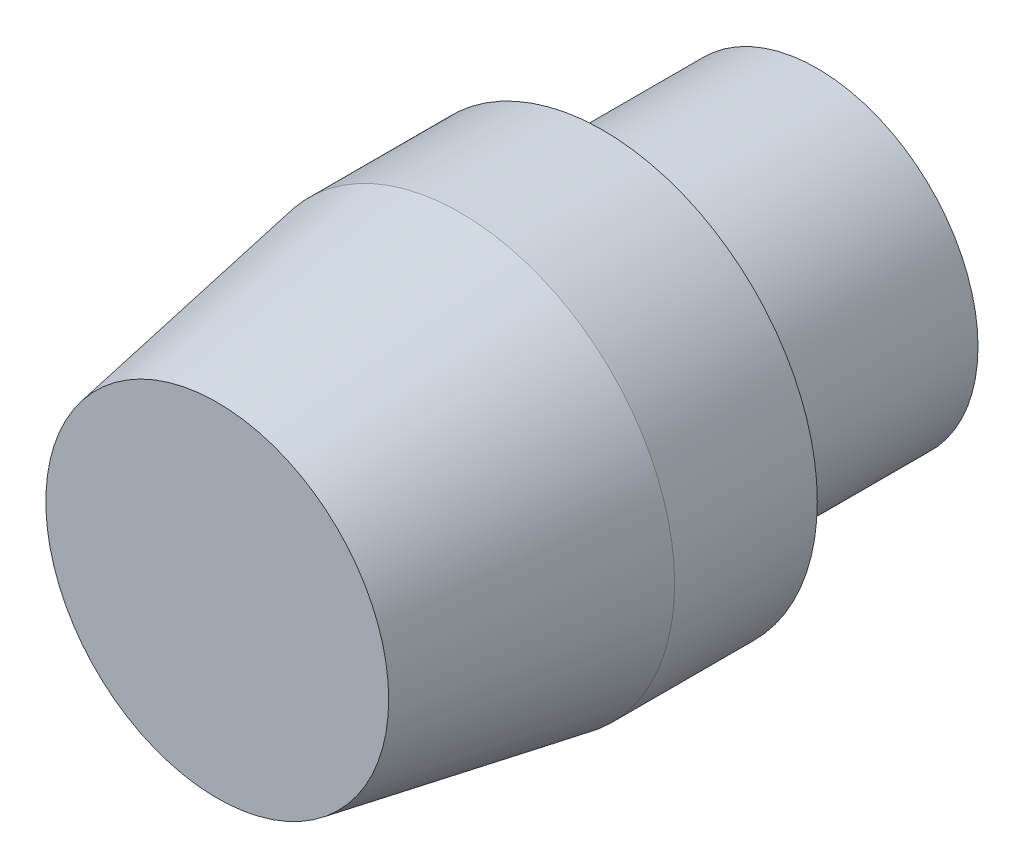
ISO-10303-21;
HEADER;
FILE_DESCRIPTION(('STEP AP214'),'2;1');
FILE_NAME('part.step','',(''),(''),'','','');
FILE_SCHEMA(('AUTOMOTIVE_DESIGN { 1 0 10303 214 1 1 1 1 }'));
ENDSEC;
DATA;
#1=APPLICATION_CONTEXT('core data for automotive mechanical design processes');
#2=APPLICATION_PROTOCOL_DEFINITION('international standard','automotive_design',2000,#1);
#3=PRODUCT_CONTEXT('',#1,'mechanical');
#4=PRODUCT('Part','Part','',(#3));
#5=PRODUCT_RELATED_PRODUCT_CATEGORY('part','',(#4));
#6=PRODUCT_DEFINITION_FORMATION('','',#4);
#7=PRODUCT_DEFINITION_CONTEXT('part definition',#1,'design');
#8=PRODUCT_DEFINITION('design','',#6,#7);
#9=PRODUCT_DEFINITION_SHAPE('','',#8);
#10=(LENGTH_UNIT() NAMED_UNIT(*) SI_UNIT(.MILLI.,.METRE.));
#11=(NAMED_UNIT(*) PLANE_ANGLE_UNIT() SI_UNIT($,.RADIAN.));
#12=(NAMED_UNIT(*) SI_UNIT($,.STERADIAN.) SOLID_ANGLE_UNIT());
#13=UNCERTAINTY_MEASURE_WITH_UNIT(LENGTH_MEASURE(1.E-05),#10,'distance_accuracy_value','');
#14=(GEOMETRIC_REPRESENTATION_CONTEXT(3) GLOBAL_UNCERTAINTY_ASSIGNED_CONTEXT((#13)) GLOBAL_UNIT_ASSIGNED_CONTEXT((#10,
#11,#12)) REPRESENTATION_CONTEXT('',''));
#15=CARTESIAN_POINT('',(0.,0.,0.));
#16=DIRECTION('',(0.,0.,1.));
#17=DIRECTION('',(1.,0.,0.));
#18=AXIS2_PLACEMENT_3D('',#15,#16,#17);
#19=CARTESIAN_POINT('',(0.,0.,10.));
#20=DIRECTION('',(0.,0.,-1.));
#21=DIRECTION('',(-1.,0.,0.));
#22=AXIS2_PLACEMENT_3D('',#19,#20,#21);
#23=CYLINDRICAL_SURFACE('',#22,7.5);
#24=CARTESIAN_POINT('',(0.,0.,10.));
#25=DIRECTION('',(0.,0.,1.));
#26=DIRECTION('',(1.,0.,0.));
#27=AXIS2_PLACEMENT_3D('',#24,#25,#26);
#28=CIRCLE('',#27,7.5);
#29=CARTESIAN_POINT('',(7.5,0.,10.));
#30=VERTEX_POINT('',#29);
#31=EDGE_CURVE('E53',#30,#30,#28,.T.);
#32=ORIENTED_EDGE('',*,*,#31,.F.);
#33=EDGE_LOOP('',(#32));
#34=FACE_BOUND('',#33,.T.);
#35=CARTESIAN_POINT('',(0.,0.,0.));
#36=DIRECTION('',(0.,0.,1.));
#37=DIRECTION('',(1.,0.,0.));
#38=AXIS2_PLACEMENT_3D('',#35,#36,#37);
#39=CIRCLE('',#38,7.5);
#40=CARTESIAN_POINT('',(7.5,0.,0.));
#41=VERTEX_POINT('',#40);
#42=EDGE_CURVE('E58',#41,#41,#39,.T.);
#43=ORIENTED_EDGE('',*,*,#42,.T.);
#44=EDGE_LOOP('',(#43));
#45=FACE_BOUND('',#44,.T.);
#46=ADVANCED_FACE('F39',(#34,#45),#23,.T.);
#47=CARTESIAN_POINT('',(0.,0.,0.));
#48=DIRECTION('',(0.,0.,1.));
#49=DIRECTION('',(1.,0.,0.));
#50=AXIS2_PLACEMENT_3D('',#47,#48,#49);
#51=PLANE('',#50);
#52=ORIENTED_EDGE('',*,*,#42,.F.);
#53=EDGE_LOOP('',(#52));
#54=FACE_BOUND('',#53,.T.);
#55=ADVANCED_FACE('F84',(#54),#51,.F.);
#56=CARTESIAN_POINT('',(0.,0.,28.));
#57=DIRECTION('',(0.,0.,-1.));
#58=DIRECTION('',(-1.,0.,0.));
#59=AXIS2_PLACEMENT_3D('',#56,#57,#58);
#60=CYLINDRICAL_SURFACE('',#59,10.);
#61=CARTESIAN_POINT('',(0.,0.,16.6574363607647));
#62=DIRECTION('',(0.,0.,1.));
#63=DIRECTION('',(1.,0.,0.));
#64=AXIS2_PLACEMENT_3D('',#61,#62,#63);
#65=CIRCLE('',#64,10.);
#66=CARTESIAN_POINT('',(10.,0.,16.6574363607647));
#67=VERTEX_POINT('',#66);
#68=EDGE_CURVE('E10',#67,#67,#65,.F.);
#69=ORIENTED_EDGE('',*,*,#68,.T.);
#70=EDGE_LOOP('',(#69));
#71=FACE_BOUND('',#70,.T.);
#72=CARTESIAN_POINT('',(0.,0.,10.));
#73=DIRECTION('',(0.,0.,1.));
#74=DIRECTION('',(1.,0.,0.));
#75=AXIS2_PLACEMENT_3D('',#72,#73,#74);
#76=CIRCLE('',#75,10.);
#77=CARTESIAN_POINT('',(10.,0.,10.));
#78=VERTEX_POINT('',#77);
#79=EDGE_CURVE('E63',#78,#78,#76,.T.);
#80=ORIENTED_EDGE('',*,*,#79,.T.);
#81=EDGE_LOOP('',(#80));
#82=FACE_BOUND('',#81,.T.);
#83=ADVANCED_FACE('F69',(#71,#82),#60,.T.);
#84=CARTESIAN_POINT('',(0.,0.,28.));
#85=DIRECTION('',(0.,0.,1.));
#86=DIRECTION('',(1.,0.,0.));
#87=AXIS2_PLACEMENT_3D('',#84,#85,#86);
#88=PLANE('',#87);
#89=CARTESIAN_POINT('',(0.,0.,28.));
#90=DIRECTION('',(0.,0.,1.));
#91=DIRECTION('',(1.,0.,0.));
#92=AXIS2_PLACEMENT_3D('',#89,#90,#91);
#93=CIRCLE('',#92,8.00000000000001);
#94=CARTESIAN_POINT('',(8.00000000000001,0.,28.));
#95=VERTEX_POINT('',#94);
#96=EDGE_CURVE('E48',#95,#95,#93,.T.);
#97=ORIENTED_EDGE('',*,*,#96,.T.);
#98=EDGE_LOOP('',(#97));
#99=FACE_BOUND('',#98,.T.);
#100=ADVANCED_FACE('F73',(#99),#88,.T.);
#101=CARTESIAN_POINT('',(0.,0.,10.));
#102=DIRECTION('',(0.,0.,1.));
#103=DIRECTION('',(1.,0.,0.));
#104=AXIS2_PLACEMENT_3D('',#101,#102,#103);
#105=PLANE('',#104);
#106=ORIENTED_EDGE('',*,*,#31,.T.);
#107=EDGE_LOOP('',(#106));
#108=FACE_BOUND('',#107,.T.);
#109=ORIENTED_EDGE('',*,*,#79,.F.);
#110=EDGE_LOOP('',(#109));
#111=FACE_BOUND('',#110,.T.);
#112=ADVANCED_FACE('F71',(#108,#111),#105,.F.);
#113=CARTESIAN_POINT('',(0.,0.,28.));
#114=DIRECTION('',(0.,0.,-1.));
#115=DIRECTION('',(-1.,0.,0.));
#116=AXIS2_PLACEMENT_3D('',#113,#114,#115);
#117=CONICAL_SURFACE('',#116,8.00000000000001,0.174532925199434);
#118=ORIENTED_EDGE('',*,*,#68,.F.);
#119=EDGE_LOOP('',(#118));
#120=FACE_BOUND('',#119,.T.);
#121=ORIENTED_EDGE('',*,*,#96,.F.);
#122=EDGE_LOOP('',(#121));
#123=FACE_BOUND('',#122,.T.);
#124=ADVANCED_FACE('F42',(#120,#123),#117,.T.);
#125=CLOSED_SHELL('',(#46,#55,#83,#100,#112,#124));
#126=MANIFOLD_SOLID_BREP('B2',#125);
#127=ADVANCED_BREP_SHAPE_REPRESENTATION('',(#18,#126),#14);
#128=SHAPE_DEFINITION_REPRESENTATION(#9,#127);
ENDSEC;
END-ISO-10303-21;
